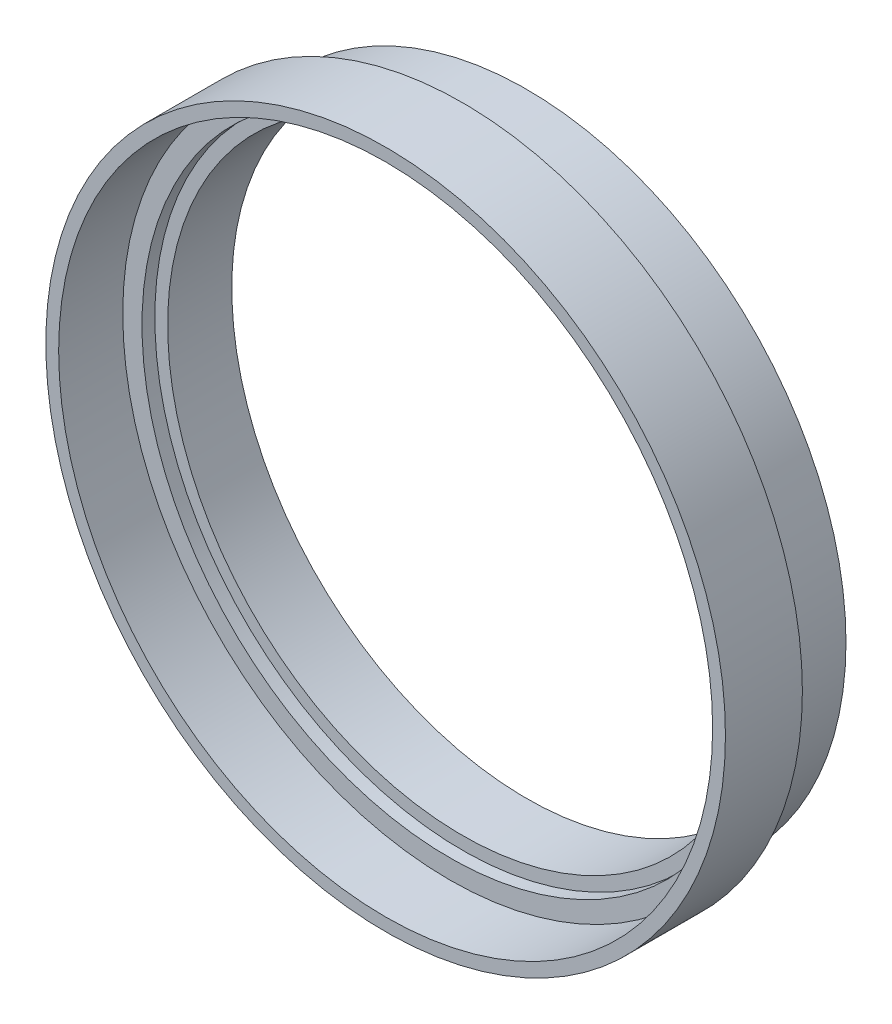
ISO-10303-21;
HEADER;
FILE_DESCRIPTION(('STEP AP214'),'2;1');
FILE_NAME('part.step','',(''),(''),'','','');
FILE_SCHEMA(('AUTOMOTIVE_DESIGN { 1 0 10303 214 1 1 1 1 }'));
ENDSEC;
DATA;
#1=APPLICATION_CONTEXT('core data for automotive mechanical design processes');
#2=APPLICATION_PROTOCOL_DEFINITION('international standard','automotive_design',2000,#1);
#3=PRODUCT_CONTEXT('',#1,'mechanical');
#4=PRODUCT('Part','Part','',(#3));
#5=PRODUCT_RELATED_PRODUCT_CATEGORY('part','',(#4));
#6=PRODUCT_DEFINITION_FORMATION('','',#4);
#7=PRODUCT_DEFINITION_CONTEXT('part definition',#1,'design');
#8=PRODUCT_DEFINITION('design','',#6,#7);
#9=PRODUCT_DEFINITION_SHAPE('','',#8);
#10=(LENGTH_UNIT() NAMED_UNIT(*) SI_UNIT(.MILLI.,.METRE.));
#11=(NAMED_UNIT(*) PLANE_ANGLE_UNIT() SI_UNIT($,.RADIAN.));
#12=(NAMED_UNIT(*) SI_UNIT($,.STERADIAN.) SOLID_ANGLE_UNIT());
#13=UNCERTAINTY_MEASURE_WITH_UNIT(LENGTH_MEASURE(1.E-05),#10,'distance_accuracy_value','');
#14=(GEOMETRIC_REPRESENTATION_CONTEXT(3) GLOBAL_UNCERTAINTY_ASSIGNED_CONTEXT((#13)) GLOBAL_UNIT_ASSIGNED_CONTEXT((#10,
#11,#12)) REPRESENTATION_CONTEXT('',''));
#15=CARTESIAN_POINT('',(0.,0.,0.));
#16=DIRECTION('',(0.,0.,1.));
#17=DIRECTION('',(1.,0.,0.));
#18=AXIS2_PLACEMENT_3D('',#15,#16,#17);
#19=CARTESIAN_POINT('',(0.,0.,6.));
#20=DIRECTION('',(0.,0.,1.));
#21=DIRECTION('',(1.,0.,0.));
#22=AXIS2_PLACEMENT_3D('',#19,#20,#21);
#23=PLANE('',#22);
#24=CARTESIAN_POINT('',(0.,0.,6.));
#25=DIRECTION('',(0.,0.,1.));
#26=DIRECTION('',(1.,0.,0.));
#27=AXIS2_PLACEMENT_3D('',#24,#25,#26);
#28=CIRCLE('',#27,24.);
#29=CARTESIAN_POINT('',(24.,0.,6.));
#30=VERTEX_POINT('',#29);
#31=EDGE_CURVE('E63',#30,#30,#28,.T.);
#32=ORIENTED_EDGE('',*,*,#31,.F.);
#33=EDGE_LOOP('',(#32));
#34=FACE_BOUND('',#33,.T.);
#35=CARTESIAN_POINT('',(0.,0.,6.));
#36=DIRECTION('',(0.,0.,1.));
#37=DIRECTION('',(1.,0.,0.));
#38=AXIS2_PLACEMENT_3D('',#35,#36,#37);
#39=CIRCLE('',#38,25.5);
#40=CARTESIAN_POINT('',(25.5,0.,6.));
#41=VERTEX_POINT('',#40);
#42=EDGE_CURVE('E10',#41,#41,#39,.F.);
#43=ORIENTED_EDGE('',*,*,#42,.F.);
#44=EDGE_LOOP('',(#43));
#45=FACE_BOUND('',#44,.T.);
#46=ADVANCED_FACE('F37',(#34,#45),#23,.T.);
#47=CARTESIAN_POINT('',(0.,0.,5.));
#48=DIRECTION('',(0.,0.,1.));
#49=DIRECTION('',(1.,0.,0.));
#50=AXIS2_PLACEMENT_3D('',#47,#48,#49);
#51=PLANE('',#50);
#52=CARTESIAN_POINT('',(0.,0.,5.));
#53=DIRECTION('',(0.,0.,1.));
#54=DIRECTION('',(1.,0.,0.));
#55=AXIS2_PLACEMENT_3D('',#52,#53,#54);
#56=CIRCLE('',#55,23.);
#57=CARTESIAN_POINT('',(23.,0.,5.));
#58=VERTEX_POINT('',#57);
#59=EDGE_CURVE('E53',#58,#58,#56,.T.);
#60=ORIENTED_EDGE('',*,*,#59,.F.);
#61=EDGE_LOOP('',(#60));
#62=FACE_BOUND('',#61,.T.);
#63=CARTESIAN_POINT('',(0.,0.,5.));
#64=DIRECTION('',(0.,0.,1.));
#65=DIRECTION('',(1.,0.,0.));
#66=AXIS2_PLACEMENT_3D('',#63,#64,#65);
#67=CIRCLE('',#66,24.);
#68=CARTESIAN_POINT('',(24.,0.,5.));
#69=VERTEX_POINT('',#68);
#70=EDGE_CURVE('E64',#69,#69,#67,.T.);
#71=ORIENTED_EDGE('',*,*,#70,.T.);
#72=EDGE_LOOP('',(#71));
#73=FACE_BOUND('',#72,.T.);
#74=ADVANCED_FACE('F92',(#62,#73),#51,.T.);
#75=CARTESIAN_POINT('',(0.,0.,0.));
#76=DIRECTION('',(0.,0.,1.));
#77=DIRECTION('',(1.,0.,0.));
#78=AXIS2_PLACEMENT_3D('',#75,#76,#77);
#79=PLANE('',#78);
#80=CARTESIAN_POINT('',(0.,0.,0.));
#81=DIRECTION('',(0.,0.,1.));
#82=DIRECTION('',(1.,0.,0.));
#83=AXIS2_PLACEMENT_3D('',#80,#81,#82);
#84=CIRCLE('',#83,24.9);
#85=CARTESIAN_POINT('',(24.9,0.,0.));
#86=VERTEX_POINT('',#85);
#87=EDGE_CURVE('E48',#86,#86,#84,.T.);
#88=ORIENTED_EDGE('',*,*,#87,.F.);
#89=EDGE_LOOP('',(#88));
#90=FACE_BOUND('',#89,.T.);
#91=CARTESIAN_POINT('',(0.,0.,0.));
#92=DIRECTION('',(0.,0.,1.));
#93=DIRECTION('',(1.,0.,0.));
#94=AXIS2_PLACEMENT_3D('',#91,#92,#93);
#95=CIRCLE('',#94,23.);
#96=CARTESIAN_POINT('',(23.,0.,0.));
#97=VERTEX_POINT('',#96);
#98=EDGE_CURVE('E55',#97,#97,#95,.T.);
#99=ORIENTED_EDGE('',*,*,#98,.T.);
#100=EDGE_LOOP('',(#99));
#101=FACE_BOUND('',#100,.T.);
#102=ADVANCED_FACE('F98',(#90,#101),#79,.F.);
#103=CARTESIAN_POINT('',(0.,0.,5.));
#104=DIRECTION('',(0.,0.,-1.));
#105=DIRECTION('',(-1.,0.,0.));
#106=AXIS2_PLACEMENT_3D('',#103,#104,#105);
#107=CYLINDRICAL_SURFACE('',#106,24.9);
#108=CARTESIAN_POINT('',(0.,0.,5.));
#109=DIRECTION('',(0.,0.,1.));
#110=DIRECTION('',(1.,0.,0.));
#111=AXIS2_PLACEMENT_3D('',#108,#109,#110);
#112=CIRCLE('',#111,24.9);
#113=CARTESIAN_POINT('',(24.9,0.,5.));
#114=VERTEX_POINT('',#113);
#115=EDGE_CURVE('E44',#114,#114,#112,.T.);
#116=ORIENTED_EDGE('',*,*,#115,.F.);
#117=EDGE_LOOP('',(#116));
#118=FACE_BOUND('',#117,.T.);
#119=ORIENTED_EDGE('',*,*,#87,.T.);
#120=EDGE_LOOP('',(#119));
#121=FACE_BOUND('',#120,.T.);
#122=ADVANCED_FACE('F39',(#118,#121),#107,.T.);
#123=CARTESIAN_POINT('',(0.,0.,5.));
#124=DIRECTION('',(0.,0.,-1.));
#125=DIRECTION('',(-1.,0.,0.));
#126=AXIS2_PLACEMENT_3D('',#123,#124,#125);
#127=CYLINDRICAL_SURFACE('',#126,23.);
#128=ORIENTED_EDGE('',*,*,#59,.T.);
#129=EDGE_LOOP('',(#128));
#130=FACE_BOUND('',#129,.T.);
#131=ORIENTED_EDGE('',*,*,#98,.F.);
#132=EDGE_LOOP('',(#131));
#133=FACE_BOUND('',#132,.T.);
#134=ADVANCED_FACE('F107',(#130,#133),#127,.F.);
#135=CARTESIAN_POINT('',(0.,0.,5.));
#136=DIRECTION('',(0.,0.,1.));
#137=DIRECTION('',(1.,0.,0.));
#138=AXIS2_PLACEMENT_3D('',#135,#136,#137);
#139=PLANE('',#138);
#140=CARTESIAN_POINT('',(0.,0.,5.));
#141=DIRECTION('',(0.,0.,1.));
#142=DIRECTION('',(1.,0.,0.));
#143=AXIS2_PLACEMENT_3D('',#140,#141,#142);
#144=CIRCLE('',#143,26.5);
#145=CARTESIAN_POINT('',(26.5,0.,5.));
#146=VERTEX_POINT('',#145);
#147=EDGE_CURVE('E58',#146,#146,#144,.T.);
#148=ORIENTED_EDGE('',*,*,#147,.F.);
#149=EDGE_LOOP('',(#148));
#150=FACE_BOUND('',#149,.T.);
#151=ORIENTED_EDGE('',*,*,#115,.T.);
#152=EDGE_LOOP('',(#151));
#153=FACE_BOUND('',#152,.T.);
#154=ADVANCED_FACE('F104',(#150,#153),#139,.F.);
#155=CARTESIAN_POINT('',(0.,0.,6.));
#156=DIRECTION('',(0.,0.,-1.));
#157=DIRECTION('',(-1.,0.,0.));
#158=AXIS2_PLACEMENT_3D('',#155,#156,#157);
#159=CYLINDRICAL_SURFACE('',#158,26.5);
#160=ORIENTED_EDGE('',*,*,#147,.T.);
#161=EDGE_LOOP('',(#160));
#162=FACE_BOUND('',#161,.T.);
#163=CARTESIAN_POINT('',(0.,0.,11.));
#164=DIRECTION('',(0.,0.,1.));
#165=DIRECTION('',(1.,0.,0.));
#166=AXIS2_PLACEMENT_3D('',#163,#164,#165);
#167=CIRCLE('',#166,26.5);
#168=CARTESIAN_POINT('',(26.5,0.,11.));
#169=VERTEX_POINT('',#168);
#170=EDGE_CURVE('E67',#169,#169,#167,.T.);
#171=ORIENTED_EDGE('',*,*,#170,.F.);
#172=EDGE_LOOP('',(#171));
#173=FACE_BOUND('',#172,.T.);
#174=ADVANCED_FACE('F88',(#162,#173),#159,.T.);
#175=CARTESIAN_POINT('',(0.,0.,6.));
#176=DIRECTION('',(0.,0.,-1.));
#177=DIRECTION('',(-1.,0.,0.));
#178=AXIS2_PLACEMENT_3D('',#175,#176,#177);
#179=CYLINDRICAL_SURFACE('',#178,24.);
#180=ORIENTED_EDGE('',*,*,#31,.T.);
#181=EDGE_LOOP('',(#180));
#182=FACE_BOUND('',#181,.T.);
#183=ORIENTED_EDGE('',*,*,#70,.F.);
#184=EDGE_LOOP('',(#183));
#185=FACE_BOUND('',#184,.T.);
#186=ADVANCED_FACE('F80',(#182,#185),#179,.F.);
#187=CARTESIAN_POINT('',(0.,0.,11.));
#188=DIRECTION('',(0.,0.,1.));
#189=DIRECTION('',(1.,0.,0.));
#190=AXIS2_PLACEMENT_3D('',#187,#188,#189);
#191=PLANE('',#190);
#192=ORIENTED_EDGE('',*,*,#170,.T.);
#193=EDGE_LOOP('',(#192));
#194=FACE_BOUND('',#193,.T.);
#195=CARTESIAN_POINT('',(0.,0.,11.));
#196=DIRECTION('',(0.,0.,1.));
#197=DIRECTION('',(1.,0.,0.));
#198=AXIS2_PLACEMENT_3D('',#195,#196,#197);
#199=CIRCLE('',#198,25.5);
#200=CARTESIAN_POINT('',(25.5,0.,11.));
#201=VERTEX_POINT('',#200);
#202=EDGE_CURVE('E72',#201,#201,#199,.T.);
#203=ORIENTED_EDGE('',*,*,#202,.F.);
#204=EDGE_LOOP('',(#203));
#205=FACE_BOUND('',#204,.T.);
#206=ADVANCED_FACE('F78',(#194,#205),#191,.T.);
#207=CARTESIAN_POINT('',(0.,0.,11.));
#208=DIRECTION('',(0.,0.,-1.));
#209=DIRECTION('',(-1.,0.,0.));
#210=AXIS2_PLACEMENT_3D('',#207,#208,#209);
#211=CYLINDRICAL_SURFACE('',#210,25.5);
#212=ORIENTED_EDGE('',*,*,#202,.T.);
#213=EDGE_LOOP('',(#212));
#214=FACE_BOUND('',#213,.T.);
#215=ORIENTED_EDGE('',*,*,#42,.T.);
#216=EDGE_LOOP('',(#215));
#217=FACE_BOUND('',#216,.T.);
#218=ADVANCED_FACE('F76',(#214,#217),#211,.F.);
#219=CLOSED_SHELL('',(#46,#74,#102,#122,#134,#154,#174,#186,#206,#218));
#220=MANIFOLD_SOLID_BREP('B2',#219);
#221=ADVANCED_BREP_SHAPE_REPRESENTATION('',(#18,#220),#14);
#222=SHAPE_DEFINITION_REPRESENTATION(#9,#221);
ENDSEC;
END-ISO-10303-21;
